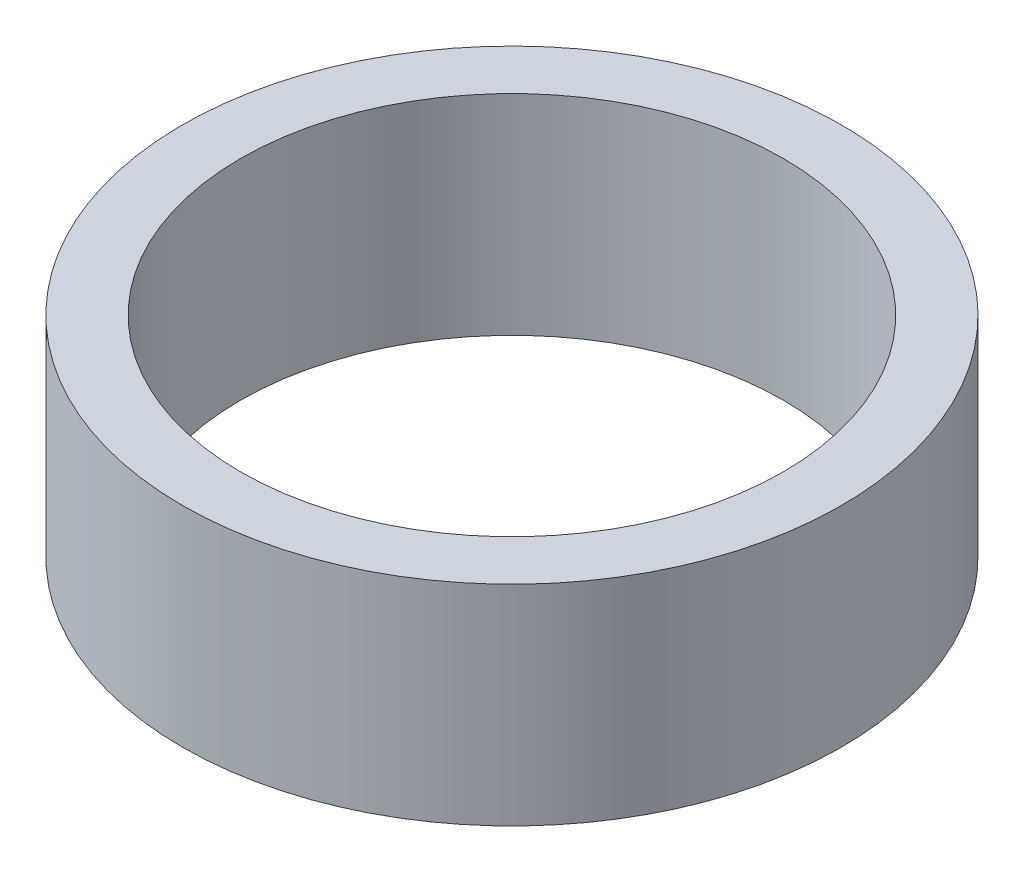
ISO-10303-21;
HEADER;
FILE_DESCRIPTION(('STEP AP214'),'2;1');
FILE_NAME('part.step','',(''),(''),'','','');
FILE_SCHEMA(('AUTOMOTIVE_DESIGN { 1 0 10303 214 1 1 1 1 }'));
ENDSEC;
DATA;
#1=APPLICATION_CONTEXT('core data for automotive mechanical design processes');
#2=APPLICATION_PROTOCOL_DEFINITION('international standard','automotive_design',2000,#1);
#3=PRODUCT_CONTEXT('',#1,'mechanical');
#4=PRODUCT('Part','Part','',(#3));
#5=PRODUCT_RELATED_PRODUCT_CATEGORY('part','',(#4));
#6=PRODUCT_DEFINITION_FORMATION('','',#4);
#7=PRODUCT_DEFINITION_CONTEXT('part definition',#1,'design');
#8=PRODUCT_DEFINITION('design','',#6,#7);
#9=PRODUCT_DEFINITION_SHAPE('','',#8);
#10=(LENGTH_UNIT() NAMED_UNIT(*) SI_UNIT(.MILLI.,.METRE.));
#11=(NAMED_UNIT(*) PLANE_ANGLE_UNIT() SI_UNIT($,.RADIAN.));
#12=(NAMED_UNIT(*) SI_UNIT($,.STERADIAN.) SOLID_ANGLE_UNIT());
#13=UNCERTAINTY_MEASURE_WITH_UNIT(LENGTH_MEASURE(1.E-05),#10,'distance_accuracy_value','');
#14=(GEOMETRIC_REPRESENTATION_CONTEXT(3) GLOBAL_UNCERTAINTY_ASSIGNED_CONTEXT((#13)) GLOBAL_UNIT_ASSIGNED_CONTEXT((#10,
#11,#12)) REPRESENTATION_CONTEXT('',''));
#15=CARTESIAN_POINT('',(0.,0.,0.));
#16=DIRECTION('',(0.,0.,1.));
#17=DIRECTION('',(1.,0.,0.));
#18=AXIS2_PLACEMENT_3D('',#15,#16,#17);
#19=CARTESIAN_POINT('',(0.,27.,0.));
#20=DIRECTION('',(0.,-1.,0.));
#21=DIRECTION('',(0.,0.,-1.));
#22=AXIS2_PLACEMENT_3D('',#19,#20,#21);
#23=CYLINDRICAL_SURFACE('',#22,42.5);
#24=CARTESIAN_POINT('',(0.,27.,0.));
#25=DIRECTION('',(0.,1.,0.));
#26=DIRECTION('',(0.,0.,1.));
#27=AXIS2_PLACEMENT_3D('',#24,#25,#26);
#28=CIRCLE('',#27,42.5);
#29=CARTESIAN_POINT('',(0.,27.,42.5));
#30=VERTEX_POINT('',#29);
#31=EDGE_CURVE('E10',#30,#30,#28,.T.);
#32=ORIENTED_EDGE('',*,*,#31,.F.);
#33=EDGE_LOOP('',(#32));
#34=FACE_BOUND('',#33,.T.);
#35=CARTESIAN_POINT('',(0.,0.,0.));
#36=DIRECTION('',(0.,1.,0.));
#37=DIRECTION('',(0.,0.,1.));
#38=AXIS2_PLACEMENT_3D('',#35,#36,#37);
#39=CIRCLE('',#38,42.5);
#40=CARTESIAN_POINT('',(0.,0.,42.5));
#41=VERTEX_POINT('',#40);
#42=EDGE_CURVE('E37',#41,#41,#39,.T.);
#43=ORIENTED_EDGE('',*,*,#42,.T.);
#44=EDGE_LOOP('',(#43));
#45=FACE_BOUND('',#44,.T.);
#46=ADVANCED_FACE('F40',(#34,#45),#23,.T.);
#47=CARTESIAN_POINT('',(0.,27.,0.));
#48=DIRECTION('',(0.,1.,0.));
#49=DIRECTION('',(0.,0.,1.));
#50=AXIS2_PLACEMENT_3D('',#47,#48,#49);
#51=PLANE('',#50);
#52=CARTESIAN_POINT('',(0.,27.,0.));
#53=DIRECTION('',(0.,1.,0.));
#54=DIRECTION('',(0.,0.,1.));
#55=AXIS2_PLACEMENT_3D('',#52,#53,#54);
#56=CIRCLE('',#55,35.);
#57=CARTESIAN_POINT('',(0.,27.,35.));
#58=VERTEX_POINT('',#57);
#59=EDGE_CURVE('E50',#58,#58,#56,.T.);
#60=ORIENTED_EDGE('',*,*,#59,.F.);
#61=EDGE_LOOP('',(#60));
#62=FACE_BOUND('',#61,.T.);
#63=ORIENTED_EDGE('',*,*,#31,.T.);
#64=EDGE_LOOP('',(#63));
#65=FACE_BOUND('',#64,.T.);
#66=ADVANCED_FACE('F59',(#62,#65),#51,.T.);
#67=CARTESIAN_POINT('',(0.,0.,0.));
#68=DIRECTION('',(0.,1.,0.));
#69=DIRECTION('',(0.,0.,1.));
#70=AXIS2_PLACEMENT_3D('',#67,#68,#69);
#71=PLANE('',#70);
#72=CARTESIAN_POINT('',(0.,0.,0.));
#73=DIRECTION('',(0.,1.,0.));
#74=DIRECTION('',(0.,0.,1.));
#75=AXIS2_PLACEMENT_3D('',#72,#73,#74);
#76=CIRCLE('',#75,35.);
#77=CARTESIAN_POINT('',(0.,0.,35.));
#78=VERTEX_POINT('',#77);
#79=EDGE_CURVE('E47',#78,#78,#76,.T.);
#80=ORIENTED_EDGE('',*,*,#79,.T.);
#81=EDGE_LOOP('',(#80));
#82=FACE_BOUND('',#81,.T.);
#83=ORIENTED_EDGE('',*,*,#42,.F.);
#84=EDGE_LOOP('',(#83));
#85=FACE_BOUND('',#84,.T.);
#86=ADVANCED_FACE('F58',(#82,#85),#71,.F.);
#87=CARTESIAN_POINT('',(0.,27.,0.));
#88=DIRECTION('',(0.,-1.,0.));
#89=DIRECTION('',(0.,0.,-1.));
#90=AXIS2_PLACEMENT_3D('',#87,#88,#89);
#91=CYLINDRICAL_SURFACE('',#90,35.);
#92=ORIENTED_EDGE('',*,*,#59,.T.);
#93=EDGE_LOOP('',(#92));
#94=FACE_BOUND('',#93,.T.);
#95=ORIENTED_EDGE('',*,*,#79,.F.);
#96=EDGE_LOOP('',(#95));
#97=FACE_BOUND('',#96,.T.);
#98=ADVANCED_FACE('F54',(#94,#97),#91,.F.);
#99=CLOSED_SHELL('',(#46,#66,#86,#98));
#100=MANIFOLD_SOLID_BREP('B2',#99);
#101=ADVANCED_BREP_SHAPE_REPRESENTATION('',(#18,#100),#14);
#102=SHAPE_DEFINITION_REPRESENTATION(#9,#101);
ENDSEC;
END-ISO-10303-21;
